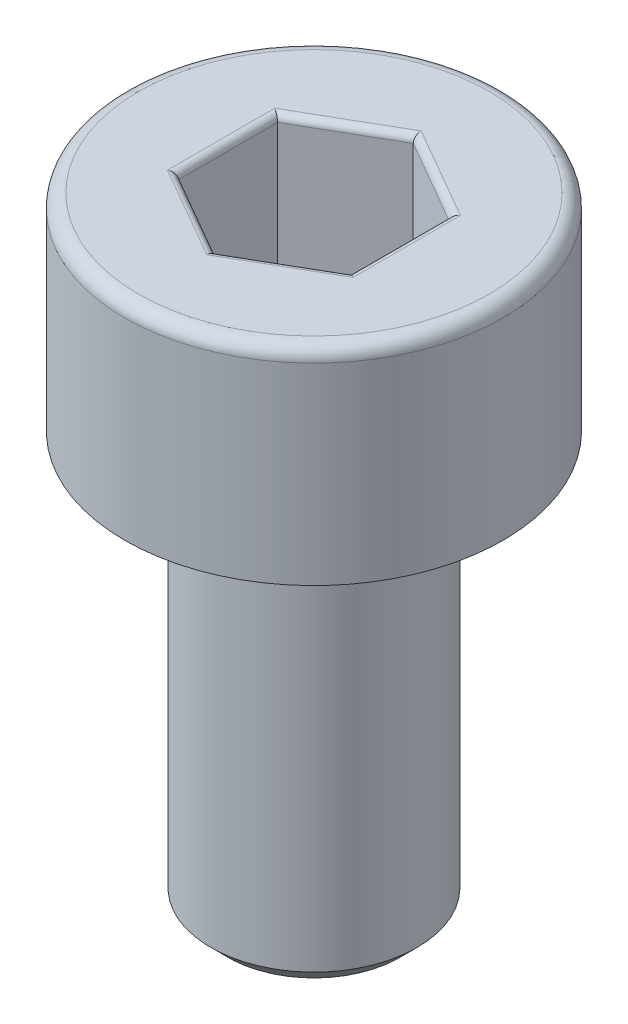
ISO-10303-21;
HEADER;
FILE_DESCRIPTION(('STEP AP214'),'2;1');
FILE_NAME('part.step','',(''),(''),'','','');
FILE_SCHEMA(('AUTOMOTIVE_DESIGN { 1 0 10303 214 1 1 1 1 }'));
ENDSEC;
DATA;
#1=APPLICATION_CONTEXT('core data for automotive mechanical design processes');
#2=APPLICATION_PROTOCOL_DEFINITION('international standard','automotive_design',2000,#1);
#3=PRODUCT_CONTEXT('',#1,'mechanical');
#4=PRODUCT('Part','Part','',(#3));
#5=PRODUCT_RELATED_PRODUCT_CATEGORY('part','',(#4));
#6=PRODUCT_DEFINITION_FORMATION('','',#4);
#7=PRODUCT_DEFINITION_CONTEXT('part definition',#1,'design');
#8=PRODUCT_DEFINITION('design','',#6,#7);
#9=PRODUCT_DEFINITION_SHAPE('','',#8);
#10=(LENGTH_UNIT() NAMED_UNIT(*) SI_UNIT(.MILLI.,.METRE.));
#11=(NAMED_UNIT(*) PLANE_ANGLE_UNIT() SI_UNIT($,.RADIAN.));
#12=(NAMED_UNIT(*) SI_UNIT($,.STERADIAN.) SOLID_ANGLE_UNIT());
#13=UNCERTAINTY_MEASURE_WITH_UNIT(LENGTH_MEASURE(1.E-05),#10,'distance_accuracy_value','');
#14=(GEOMETRIC_REPRESENTATION_CONTEXT(3) GLOBAL_UNCERTAINTY_ASSIGNED_CONTEXT((#13)) GLOBAL_UNIT_ASSIGNED_CONTEXT((#10,
#11,#12)) REPRESENTATION_CONTEXT('',''));
#15=CARTESIAN_POINT('',(0.,0.,0.));
#16=DIRECTION('',(0.,0.,1.));
#17=DIRECTION('',(1.,0.,0.));
#18=AXIS2_PLACEMENT_3D('',#15,#16,#17);
#19=CARTESIAN_POINT('',(0.,-9.,0.));
#20=DIRECTION('',(0.,-1.,0.));
#21=DIRECTION('',(0.,0.,-1.));
#22=AXIS2_PLACEMENT_3D('',#19,#20,#21);
#23=PLANE('',#22);
#24=CARTESIAN_POINT('',(0.,-9.,0.));
#25=DIRECTION('',(0.,-1.,0.));
#26=DIRECTION('',(0.,0.,-1.));
#27=AXIS2_PLACEMENT_3D('',#24,#25,#26);
#28=CIRCLE('',#27,1.25);
#29=CARTESIAN_POINT('',(0.,-9.,-1.25));
#30=VERTEX_POINT('',#29);
#31=EDGE_CURVE('E263',#30,#30,#28,.T.);
#32=ORIENTED_EDGE('',*,*,#31,.T.);
#33=EDGE_LOOP('',(#32));
#34=FACE_BOUND('',#33,.T.);
#35=ADVANCED_FACE('F35',(#34),#23,.T.);
#36=CARTESIAN_POINT('',(0.,0.,0.));
#37=DIRECTION('',(0.,1.,0.));
#38=DIRECTION('',(0.,0.,1.));
#39=AXIS2_PLACEMENT_3D('',#36,#37,#38);
#40=CYLINDRICAL_SURFACE('',#39,1.5);
#41=CARTESIAN_POINT('',(0.,-3.25,0.));
#42=DIRECTION('',(0.,-1.,0.));
#43=DIRECTION('',(0.,0.,-1.));
#44=AXIS2_PLACEMENT_3D('',#41,#42,#43);
#45=CIRCLE('',#44,1.5);
#46=CARTESIAN_POINT('',(0.,-3.25,-1.5));
#47=VERTEX_POINT('',#46);
#48=EDGE_CURVE('E260',#47,#47,#45,.T.);
#49=ORIENTED_EDGE('',*,*,#48,.T.);
#50=EDGE_LOOP('',(#49));
#51=FACE_BOUND('',#50,.T.);
#52=CARTESIAN_POINT('',(0.,-8.75,0.));
#53=DIRECTION('',(0.,-1.,0.));
#54=DIRECTION('',(0.,0.,-1.));
#55=AXIS2_PLACEMENT_3D('',#52,#53,#54);
#56=CIRCLE('',#55,1.5);
#57=CARTESIAN_POINT('',(0.,-8.75,-1.5));
#58=VERTEX_POINT('',#57);
#59=EDGE_CURVE('E257',#58,#58,#56,.F.);
#60=ORIENTED_EDGE('',*,*,#59,.T.);
#61=EDGE_LOOP('',(#60));
#62=FACE_BOUND('',#61,.T.);
#63=ADVANCED_FACE('F289',(#51,#62),#40,.T.);
#64=CARTESIAN_POINT('',(-1.5,-3.,0.));
#65=DIRECTION('',(0.,-1.,0.));
#66=DIRECTION('',(0.,0.,-1.));
#67=AXIS2_PLACEMENT_3D('',#64,#65,#66);
#68=PLANE('',#67);
#69=CARTESIAN_POINT('',(0.,-3.,0.));
#70=DIRECTION('',(0.,-1.,0.));
#71=DIRECTION('',(0.,0.,-1.));
#72=AXIS2_PLACEMENT_3D('',#69,#70,#71);
#73=CIRCLE('',#72,1.75);
#74=CARTESIAN_POINT('',(0.,-3.,-1.75));
#75=VERTEX_POINT('',#74);
#76=EDGE_CURVE('E254',#75,#75,#73,.F.);
#77=ORIENTED_EDGE('',*,*,#76,.T.);
#78=EDGE_LOOP('',(#77));
#79=FACE_BOUND('',#78,.T.);
#80=CARTESIAN_POINT('',(0.,-3.,0.));
#81=DIRECTION('',(0.,1.,0.));
#82=DIRECTION('',(0.,0.,1.));
#83=AXIS2_PLACEMENT_3D('',#80,#81,#82);
#84=CIRCLE('',#83,2.75);
#85=CARTESIAN_POINT('',(0.,-3.,2.75));
#86=VERTEX_POINT('',#85);
#87=EDGE_CURVE('E251',#86,#86,#84,.T.);
#88=ORIENTED_EDGE('',*,*,#87,.F.);
#89=EDGE_LOOP('',(#88));
#90=FACE_BOUND('',#89,.T.);
#91=ADVANCED_FACE('F295',(#79,#90),#68,.T.);
#92=CARTESIAN_POINT('',(0.,0.,0.));
#93=DIRECTION('',(0.,1.,0.));
#94=DIRECTION('',(0.,0.,1.));
#95=AXIS2_PLACEMENT_3D('',#92,#93,#94);
#96=CYLINDRICAL_SURFACE('',#95,2.75);
#97=CARTESIAN_POINT('',(0.,-0.2,0.));
#98=DIRECTION('',(0.,1.,0.));
#99=DIRECTION('',(0.,0.,1.));
#100=AXIS2_PLACEMENT_3D('',#97,#98,#99);
#101=CIRCLE('',#100,2.75);
#102=CARTESIAN_POINT('',(0.,-0.2,2.75));
#103=VERTEX_POINT('',#102);
#104=EDGE_CURVE('E161',#103,#103,#101,.F.);
#105=ORIENTED_EDGE('',*,*,#104,.T.);
#106=EDGE_LOOP('',(#105));
#107=FACE_BOUND('',#106,.T.);
#108=ORIENTED_EDGE('',*,*,#87,.T.);
#109=EDGE_LOOP('',(#108));
#110=FACE_BOUND('',#109,.T.);
#111=ADVANCED_FACE('F305',(#107,#110),#96,.T.);
#112=CARTESIAN_POINT('',(-2.75,0.,0.));
#113=DIRECTION('',(0.,1.,0.));
#114=DIRECTION('',(0.,0.,1.));
#115=AXIS2_PLACEMENT_3D('',#112,#113,#114);
#116=PLANE('',#115);
#117=DIRECTION('',(0.,0.,1.));
#118=VECTOR('',#117,1.);
#119=CARTESIAN_POINT('',(-1.35,0.,-0.721687836487033));
#120=LINE('',#119,#118);
#121=CARTESIAN_POINT('',(-1.35,0.,0.779422863405995));
#122=VERTEX_POINT('',#121);
#123=CARTESIAN_POINT('',(-1.35,0.,-0.779422863405995));
#124=VERTEX_POINT('',#123);
#125=EDGE_CURVE('E177',#122,#124,#120,.F.);
#126=ORIENTED_EDGE('',*,*,#125,.T.);
#127=DIRECTION('',(-0.866025403784439,0.,0.5));
#128=VECTOR('',#127,1.);
#129=CARTESIAN_POINT('',(-0.0500000000000002,0.,-1.52997821335251));
#130=LINE('',#129,#128);
#131=CARTESIAN_POINT('',(0.,0.,-1.55884572681199));
#132=VERTEX_POINT('',#131);
#133=EDGE_CURVE('E136',#124,#132,#130,.F.);
#134=ORIENTED_EDGE('',*,*,#133,.T.);
#135=DIRECTION('',(-0.866025403784439,0.,-0.5));
#136=VECTOR('',#135,1.);
#137=CARTESIAN_POINT('',(1.3,0.,-0.808290376865477));
#138=LINE('',#137,#136);
#139=CARTESIAN_POINT('',(1.35,0.,-0.779422863405995));
#140=VERTEX_POINT('',#139);
#141=EDGE_CURVE('E163',#132,#140,#138,.F.);
#142=ORIENTED_EDGE('',*,*,#141,.T.);
#143=DIRECTION('',(0.,0.,-1.));
#144=VECTOR('',#143,1.);
#145=CARTESIAN_POINT('',(1.35,0.,0.721687836487034));
#146=LINE('',#145,#144);
#147=CARTESIAN_POINT('',(1.35,0.,0.779422863405996));
#148=VERTEX_POINT('',#147);
#149=EDGE_CURVE('E171',#140,#148,#146,.F.);
#150=ORIENTED_EDGE('',*,*,#149,.T.);
#151=DIRECTION('',(0.866025403784439,0.,-0.5));
#152=VECTOR('',#151,1.);
#153=CARTESIAN_POINT('',(0.05,0.,1.52997821335251));
#154=LINE('',#153,#152);
#155=CARTESIAN_POINT('',(0.,0.,1.55884572681199));
#156=VERTEX_POINT('',#155);
#157=EDGE_CURVE('E173',#148,#156,#154,.F.);
#158=ORIENTED_EDGE('',*,*,#157,.T.);
#159=DIRECTION('',(0.866025403784438,0.,0.5));
#160=VECTOR('',#159,1.);
#161=CARTESIAN_POINT('',(-1.3,0.,0.808290376865476));
#162=LINE('',#161,#160);
#163=EDGE_CURVE('E175',#156,#122,#162,.F.);
#164=ORIENTED_EDGE('',*,*,#163,.T.);
#165=EDGE_LOOP('',(#126,#134,#142,#150,#158,#164));
#166=FACE_BOUND('',#165,.T.);
#167=CARTESIAN_POINT('',(0.,0.,0.));
#168=DIRECTION('',(0.,1.,0.));
#169=DIRECTION('',(0.,0.,1.));
#170=AXIS2_PLACEMENT_3D('',#167,#168,#169);
#171=CIRCLE('',#170,2.55);
#172=CARTESIAN_POINT('',(0.,0.,2.55));
#173=VERTEX_POINT('',#172);
#174=EDGE_CURVE('E166',#173,#173,#171,.T.);
#175=ORIENTED_EDGE('',*,*,#174,.T.);
#176=EDGE_LOOP('',(#175));
#177=FACE_BOUND('',#176,.T.);
#178=ADVANCED_FACE('F268',(#166,#177),#116,.T.);
#179=CARTESIAN_POINT('',(0.,-3.,0.));
#180=DIRECTION('',(0.,1.,0.));
#181=DIRECTION('',(0.,0.,1.));
#182=AXIS2_PLACEMENT_3D('',#179,#180,#181);
#183=CONICAL_SURFACE('',#182,1.75,0.785398163397453);
#184=ORIENTED_EDGE('',*,*,#48,.F.);
#185=EDGE_LOOP('',(#184));
#186=FACE_BOUND('',#185,.T.);
#187=ORIENTED_EDGE('',*,*,#76,.F.);
#188=EDGE_LOOP('',(#187));
#189=FACE_BOUND('',#188,.T.);
#190=ADVANCED_FACE('F283',(#186,#189),#183,.T.);
#191=CARTESIAN_POINT('',(0.,-8.75,0.));
#192=DIRECTION('',(0.,1.,0.));
#193=DIRECTION('',(0.,0.,1.));
#194=AXIS2_PLACEMENT_3D('',#191,#192,#193);
#195=CONICAL_SURFACE('',#194,1.5,0.785398163397454);
#196=ORIENTED_EDGE('',*,*,#31,.F.);
#197=EDGE_LOOP('',(#196));
#198=FACE_BOUND('',#197,.T.);
#199=ORIENTED_EDGE('',*,*,#59,.F.);
#200=EDGE_LOOP('',(#199));
#201=FACE_BOUND('',#200,.T.);
#202=ADVANCED_FACE('F273',(#198,#201),#195,.T.);
#203=CARTESIAN_POINT('',(0.,-0.2,0.));
#204=DIRECTION('',(0.,1.,0.));
#205=DIRECTION('',(0.,0.,1.));
#206=AXIS2_PLACEMENT_3D('',#203,#204,#205);
#207=TOROIDAL_SURFACE('',#206,2.55,0.2);
#208=ORIENTED_EDGE('',*,*,#104,.F.);
#209=EDGE_LOOP('',(#208));
#210=FACE_BOUND('',#209,.T.);
#211=ORIENTED_EDGE('',*,*,#174,.F.);
#212=EDGE_LOOP('',(#211));
#213=FACE_BOUND('',#212,.T.);
#214=ADVANCED_FACE('F270',(#210,#213),#207,.T.);
#215=CARTESIAN_POINT('',(1.25,-2.,-0.721687836487033));
#216=DIRECTION('',(0.5,0.,-0.866025403784439));
#217=DIRECTION('',(-0.866025403784439,0.,-0.5));
#218=AXIS2_PLACEMENT_3D('',#215,#216,#217);
#219=PLANE('',#218);
#220=DIRECTION('',(0.,1.,0.));
#221=VECTOR('',#220,1.);
#222=CARTESIAN_POINT('',(1.25,-2.,-0.721687836487033));
#223=LINE('',#222,#221);
#224=CARTESIAN_POINT('',(1.25,-1.9,-0.721687836487033));
#225=VERTEX_POINT('',#224);
#226=CARTESIAN_POINT('',(1.25,-0.1,-0.721687836487033));
#227=VERTEX_POINT('',#226);
#228=EDGE_CURVE('E245',#225,#227,#223,.T.);
#229=ORIENTED_EDGE('',*,*,#228,.T.);
#230=DIRECTION('',(-0.866025403784439,0.,-0.5));
#231=VECTOR('',#230,1.);
#232=CARTESIAN_POINT('',(0.,-0.1,-1.44337567297406));
#233=LINE('',#232,#231);
#234=CARTESIAN_POINT('',(0.,-0.1,-1.44337567297406));
#235=VERTEX_POINT('',#234);
#236=EDGE_CURVE('E197',#227,#235,#233,.T.);
#237=ORIENTED_EDGE('',*,*,#236,.T.);
#238=DIRECTION('',(0.,1.,0.));
#239=VECTOR('',#238,1.);
#240=CARTESIAN_POINT('',(0.,-2.,-1.44337567297406));
#241=LINE('',#240,#239);
#242=CARTESIAN_POINT('',(0.,-1.9,-1.44337567297406));
#243=VERTEX_POINT('',#242);
#244=EDGE_CURVE('E147',#243,#235,#241,.T.);
#245=ORIENTED_EDGE('',*,*,#244,.F.);
#246=DIRECTION('',(-0.866025403784439,0.,-0.5));
#247=VECTOR('',#246,1.);
#248=CARTESIAN_POINT('',(1.25,-1.9,-0.721687836487033));
#249=LINE('',#248,#247);
#250=EDGE_CURVE('E195',#243,#225,#249,.F.);
#251=ORIENTED_EDGE('',*,*,#250,.T.);
#252=EDGE_LOOP('',(#229,#237,#245,#251));
#253=FACE_BOUND('',#252,.T.);
#254=ADVANCED_FACE('F272',(#253),#219,.F.);
#255=CARTESIAN_POINT('',(1.25,-2.,0.721687836487034));
#256=DIRECTION('',(1.,0.,0.));
#257=DIRECTION('',(0.,0.,-1.));
#258=AXIS2_PLACEMENT_3D('',#255,#256,#257);
#259=PLANE('',#258);
#260=DIRECTION('',(0.,1.,0.));
#261=VECTOR('',#260,1.);
#262=CARTESIAN_POINT('',(1.25,-2.,0.721687836487034));
#263=LINE('',#262,#261);
#264=CARTESIAN_POINT('',(1.25,-1.9,0.721687836487034));
#265=VERTEX_POINT('',#264);
#266=CARTESIAN_POINT('',(1.25,-0.1,0.721687836487034));
#267=VERTEX_POINT('',#266);
#268=EDGE_CURVE('E242',#265,#267,#263,.T.);
#269=ORIENTED_EDGE('',*,*,#268,.T.);
#270=DIRECTION('',(0.,0.,-1.));
#271=VECTOR('',#270,1.);
#272=CARTESIAN_POINT('',(1.25,-0.1,-0.721687836487033));
#273=LINE('',#272,#271);
#274=EDGE_CURVE('E193',#267,#227,#273,.T.);
#275=ORIENTED_EDGE('',*,*,#274,.T.);
#276=ORIENTED_EDGE('',*,*,#228,.F.);
#277=DIRECTION('',(0.,0.,-1.));
#278=VECTOR('',#277,1.);
#279=CARTESIAN_POINT('',(1.25,-1.9,0.721687836487034));
#280=LINE('',#279,#278);
#281=EDGE_CURVE('E190',#225,#265,#280,.F.);
#282=ORIENTED_EDGE('',*,*,#281,.T.);
#283=EDGE_LOOP('',(#269,#275,#276,#282));
#284=FACE_BOUND('',#283,.T.);
#285=ADVANCED_FACE('F280',(#284),#259,.F.);
#286=CARTESIAN_POINT('',(0.,-2.,1.44337567297407));
#287=DIRECTION('',(0.5,0.,0.866025403784439));
#288=DIRECTION('',(0.866025403784439,0.,-0.5));
#289=AXIS2_PLACEMENT_3D('',#286,#287,#288);
#290=PLANE('',#289);
#291=DIRECTION('',(0.,1.,0.));
#292=VECTOR('',#291,1.);
#293=CARTESIAN_POINT('',(0.,-2.,1.44337567297407));
#294=LINE('',#293,#292);
#295=CARTESIAN_POINT('',(0.,-1.9,1.44337567297407));
#296=VERTEX_POINT('',#295);
#297=CARTESIAN_POINT('',(0.,-0.1,1.44337567297407));
#298=VERTEX_POINT('',#297);
#299=EDGE_CURVE('E239',#296,#298,#294,.T.);
#300=ORIENTED_EDGE('',*,*,#299,.T.);
#301=DIRECTION('',(0.866025403784439,0.,-0.5));
#302=VECTOR('',#301,1.);
#303=CARTESIAN_POINT('',(1.25,-0.1,0.721687836487034));
#304=LINE('',#303,#302);
#305=EDGE_CURVE('E188',#298,#267,#304,.T.);
#306=ORIENTED_EDGE('',*,*,#305,.T.);
#307=ORIENTED_EDGE('',*,*,#268,.F.);
#308=DIRECTION('',(0.866025403784439,0.,-0.5));
#309=VECTOR('',#308,1.);
#310=CARTESIAN_POINT('',(0.,-1.9,1.44337567297407));
#311=LINE('',#310,#309);
#312=EDGE_CURVE('E186',#265,#296,#311,.F.);
#313=ORIENTED_EDGE('',*,*,#312,.T.);
#314=EDGE_LOOP('',(#300,#306,#307,#313));
#315=FACE_BOUND('',#314,.T.);
#316=ADVANCED_FACE('F329',(#315),#290,.F.);
#317=CARTESIAN_POINT('',(-1.25,-2.,0.721687836487033));
#318=DIRECTION('',(-0.5,0.,0.866025403784439));
#319=DIRECTION('',(0.866025403784438,0.,0.5));
#320=AXIS2_PLACEMENT_3D('',#317,#318,#319);
#321=PLANE('',#320);
#322=DIRECTION('',(0.,1.,0.));
#323=VECTOR('',#322,1.);
#324=CARTESIAN_POINT('',(-1.25,-2.,0.721687836487033));
#325=LINE('',#324,#323);
#326=CARTESIAN_POINT('',(-1.25,-1.9,0.721687836487033));
#327=VERTEX_POINT('',#326);
#328=CARTESIAN_POINT('',(-1.25,-0.1,0.721687836487033));
#329=VERTEX_POINT('',#328);
#330=EDGE_CURVE('E130',#327,#329,#325,.T.);
#331=ORIENTED_EDGE('',*,*,#330,.T.);
#332=DIRECTION('',(0.866025403784438,0.,0.5));
#333=VECTOR('',#332,1.);
#334=CARTESIAN_POINT('',(0.,-0.1,1.44337567297407));
#335=LINE('',#334,#333);
#336=EDGE_CURVE('E184',#329,#298,#335,.T.);
#337=ORIENTED_EDGE('',*,*,#336,.T.);
#338=ORIENTED_EDGE('',*,*,#299,.F.);
#339=DIRECTION('',(0.866025403784438,0.,0.5));
#340=VECTOR('',#339,1.);
#341=CARTESIAN_POINT('',(-1.25,-1.9,0.721687836487033));
#342=LINE('',#341,#340);
#343=EDGE_CURVE('E182',#296,#327,#342,.F.);
#344=ORIENTED_EDGE('',*,*,#343,.T.);
#345=EDGE_LOOP('',(#331,#337,#338,#344));
#346=FACE_BOUND('',#345,.T.);
#347=ADVANCED_FACE('F236',(#346),#321,.F.);
#348=CARTESIAN_POINT('',(-1.25,-2.,-0.721687836487033));
#349=DIRECTION('',(-1.,0.,0.));
#350=DIRECTION('',(0.,0.,1.));
#351=AXIS2_PLACEMENT_3D('',#348,#349,#350);
#352=PLANE('',#351);
#353=DIRECTION('',(0.,1.,0.));
#354=VECTOR('',#353,1.);
#355=CARTESIAN_POINT('',(-1.25,-2.,-0.721687836487033));
#356=LINE('',#355,#354);
#357=CARTESIAN_POINT('',(-1.25,-1.9,-0.721687836487033));
#358=VERTEX_POINT('',#357);
#359=CARTESIAN_POINT('',(-1.25,-0.1,-0.721687836487033));
#360=VERTEX_POINT('',#359);
#361=EDGE_CURVE('E128',#358,#360,#356,.T.);
#362=ORIENTED_EDGE('',*,*,#361,.T.);
#363=DIRECTION('',(0.,0.,1.));
#364=VECTOR('',#363,1.);
#365=CARTESIAN_POINT('',(-1.25,-0.1,0.721687836487033));
#366=LINE('',#365,#364);
#367=EDGE_CURVE('E135',#360,#329,#366,.T.);
#368=ORIENTED_EDGE('',*,*,#367,.T.);
#369=ORIENTED_EDGE('',*,*,#330,.F.);
#370=DIRECTION('',(0.,0.,1.));
#371=VECTOR('',#370,1.);
#372=CARTESIAN_POINT('',(-1.25,-1.9,-0.721687836487033));
#373=LINE('',#372,#371);
#374=EDGE_CURVE('E125',#327,#358,#373,.F.);
#375=ORIENTED_EDGE('',*,*,#374,.T.);
#376=EDGE_LOOP('',(#362,#368,#369,#375));
#377=FACE_BOUND('',#376,.T.);
#378=ADVANCED_FACE('F127',(#377),#352,.F.);
#379=CARTESIAN_POINT('',(0.,-2.,-1.44337567297406));
#380=DIRECTION('',(-0.5,0.,-0.866025403784439));
#381=DIRECTION('',(-0.866025403784439,0.,0.5));
#382=AXIS2_PLACEMENT_3D('',#379,#380,#381);
#383=PLANE('',#382);
#384=ORIENTED_EDGE('',*,*,#244,.T.);
#385=DIRECTION('',(-0.866025403784439,0.,0.5));
#386=VECTOR('',#385,1.);
#387=CARTESIAN_POINT('',(-1.25,-0.1,-0.721687836487032));
#388=LINE('',#387,#386);
#389=EDGE_CURVE('E146',#235,#360,#388,.T.);
#390=ORIENTED_EDGE('',*,*,#389,.T.);
#391=ORIENTED_EDGE('',*,*,#361,.F.);
#392=DIRECTION('',(-0.866025403784439,0.,0.5));
#393=VECTOR('',#392,1.);
#394=CARTESIAN_POINT('',(0.,-1.9,-1.44337567297406));
#395=LINE('',#394,#393);
#396=EDGE_CURVE('E143',#358,#243,#395,.F.);
#397=ORIENTED_EDGE('',*,*,#396,.T.);
#398=EDGE_LOOP('',(#384,#390,#391,#397));
#399=FACE_BOUND('',#398,.T.);
#400=ADVANCED_FACE('F141',(#399),#383,.F.);
#401=CARTESIAN_POINT('',(1.25,-2.,-0.721687836487033));
#402=DIRECTION('',(0.,-1.,0.));
#403=DIRECTION('',(0.,0.,-1.));
#404=AXIS2_PLACEMENT_3D('',#401,#402,#403);
#405=PLANE('',#404);
#406=DIRECTION('',(0.866025403784439,0.,-0.5));
#407=VECTOR('',#406,1.);
#408=CARTESIAN_POINT('',(1.2,-2.,0.63508529610859));
#409=LINE('',#408,#407);
#410=CARTESIAN_POINT('',(0.,-2.,1.32790561913614));
#411=VERTEX_POINT('',#410);
#412=CARTESIAN_POINT('',(1.15,-2.,0.663952809568071));
#413=VERTEX_POINT('',#412);
#414=EDGE_CURVE('E44',#411,#413,#409,.T.);
#415=ORIENTED_EDGE('',*,*,#414,.T.);
#416=DIRECTION('',(0.,0.,-1.));
#417=VECTOR('',#416,1.);
#418=CARTESIAN_POINT('',(1.15,-2.,-0.721687836487033));
#419=LINE('',#418,#417);
#420=CARTESIAN_POINT('',(1.15,-2.,-0.66395280956807));
#421=VERTEX_POINT('',#420);
#422=EDGE_CURVE('E11',#413,#421,#419,.T.);
#423=ORIENTED_EDGE('',*,*,#422,.T.);
#424=DIRECTION('',(-0.866025403784439,0.,-0.5));
#425=VECTOR('',#424,1.);
#426=CARTESIAN_POINT('',(-0.0500000000000001,-2.,-1.35677313259562));
#427=LINE('',#426,#425);
#428=CARTESIAN_POINT('',(0.,-2.,-1.32790561913614));
#429=VERTEX_POINT('',#428);
#430=EDGE_CURVE('E199',#421,#429,#427,.T.);
#431=ORIENTED_EDGE('',*,*,#430,.T.);
#432=DIRECTION('',(-0.866025403784439,0.,0.5));
#433=VECTOR('',#432,1.);
#434=CARTESIAN_POINT('',(-1.2,-2.,-0.635085296108588));
#435=LINE('',#434,#433);
#436=CARTESIAN_POINT('',(-1.15,-2.,-0.66395280956807));
#437=VERTEX_POINT('',#436);
#438=EDGE_CURVE('E201',#429,#437,#435,.T.);
#439=ORIENTED_EDGE('',*,*,#438,.T.);
#440=DIRECTION('',(0.,0.,1.));
#441=VECTOR('',#440,1.);
#442=CARTESIAN_POINT('',(-1.15,-2.,0.721687836487033));
#443=LINE('',#442,#441);
#444=CARTESIAN_POINT('',(-1.15,-2.,0.66395280956807));
#445=VERTEX_POINT('',#444);
#446=EDGE_CURVE('E152',#437,#445,#443,.T.);
#447=ORIENTED_EDGE('',*,*,#446,.T.);
#448=DIRECTION('',(0.866025403784438,0.,0.5));
#449=VECTOR('',#448,1.);
#450=CARTESIAN_POINT('',(0.0499999999999999,-2.,1.35677313259562));
#451=LINE('',#450,#449);
#452=EDGE_CURVE('E55',#445,#411,#451,.T.);
#453=ORIENTED_EDGE('',*,*,#452,.T.);
#454=EDGE_LOOP('',(#415,#423,#431,#439,#447,#453));
#455=FACE_BOUND('',#454,.T.);
#456=ADVANCED_FACE('F324',(#455),#405,.F.);
#457=CARTESIAN_POINT('',(0.05,-0.1,1.52997821335251));
#458=DIRECTION('',(-0.866025403784439,0.,0.5));
#459=DIRECTION('',(0.5,0.,0.866025403784439));
#460=AXIS2_PLACEMENT_3D('',#457,#458,#459);
#461=CYLINDRICAL_SURFACE('',#460,0.1);
#462=CARTESIAN_POINT('',(0.,-0.1,1.55884572681199));
#463=DIRECTION('',(-1.,0.,0.));
#464=DIRECTION('',(0.,0.,-1.));
#465=AXIS2_PLACEMENT_3D('',#462,#463,#464);
#466=ELLIPSE('',#465,0.115470053837925,0.1);
#467=EDGE_CURVE('E216',#156,#298,#466,.T.);
#468=ORIENTED_EDGE('',*,*,#467,.F.);
#469=ORIENTED_EDGE('',*,*,#157,.F.);
#470=CARTESIAN_POINT('',(1.35,-0.1,0.779422863405997));
#471=DIRECTION('',(-0.5,0.,0.866025403784438));
#472=DIRECTION('',(-0.866025403784438,0.,-0.5));
#473=AXIS2_PLACEMENT_3D('',#470,#471,#472);
#474=ELLIPSE('',#473,0.115470053837925,0.1);
#475=EDGE_CURVE('E219',#267,#148,#474,.F.);
#476=ORIENTED_EDGE('',*,*,#475,.F.);
#477=ORIENTED_EDGE('',*,*,#305,.F.);
#478=EDGE_LOOP('',(#468,#469,#476,#477));
#479=FACE_BOUND('',#478,.T.);
#480=ADVANCED_FACE('F336',(#479),#461,.T.);
#481=CARTESIAN_POINT('',(1.35,-0.1,0.721687836487034));
#482=DIRECTION('',(0.,0.,1.));
#483=DIRECTION('',(1.,0.,0.));
#484=AXIS2_PLACEMENT_3D('',#481,#482,#483);
#485=CYLINDRICAL_SURFACE('',#484,0.1);
#486=ORIENTED_EDGE('',*,*,#475,.T.);
#487=ORIENTED_EDGE('',*,*,#149,.F.);
#488=CARTESIAN_POINT('',(1.35,-0.1,-0.779422863405995));
#489=DIRECTION('',(0.5,0.,0.866025403784439));
#490=DIRECTION('',(-0.866025403784439,0.,0.5));
#491=AXIS2_PLACEMENT_3D('',#488,#489,#490);
#492=ELLIPSE('',#491,0.115470053837925,0.1);
#493=EDGE_CURVE('E213',#227,#140,#492,.F.);
#494=ORIENTED_EDGE('',*,*,#493,.F.);
#495=ORIENTED_EDGE('',*,*,#274,.F.);
#496=EDGE_LOOP('',(#486,#487,#494,#495));
#497=FACE_BOUND('',#496,.T.);
#498=ADVANCED_FACE('F340',(#497),#485,.T.);
#499=CARTESIAN_POINT('',(-1.3,-0.1,0.808290376865476));
#500=DIRECTION('',(-0.866025403784438,0.,-0.5));
#501=DIRECTION('',(-0.5,0.,0.866025403784439));
#502=AXIS2_PLACEMENT_3D('',#499,#500,#501);
#503=CYLINDRICAL_SURFACE('',#502,0.1);
#504=ORIENTED_EDGE('',*,*,#467,.T.);
#505=ORIENTED_EDGE('',*,*,#336,.F.);
#506=CARTESIAN_POINT('',(-1.35,-0.1,0.779422863405995));
#507=DIRECTION('',(-0.5,0.,-0.866025403784439));
#508=DIRECTION('',(0.866025403784439,0.,-0.5));
#509=AXIS2_PLACEMENT_3D('',#506,#507,#508);
#510=ELLIPSE('',#509,0.115470053837925,0.1);
#511=EDGE_CURVE('E210',#122,#329,#510,.T.);
#512=ORIENTED_EDGE('',*,*,#511,.F.);
#513=ORIENTED_EDGE('',*,*,#163,.F.);
#514=EDGE_LOOP('',(#504,#505,#512,#513));
#515=FACE_BOUND('',#514,.T.);
#516=ADVANCED_FACE('F346',(#515),#503,.T.);
#517=CARTESIAN_POINT('',(1.3,-0.1,-0.808290376865477));
#518=DIRECTION('',(0.866025403784439,0.,0.5));
#519=DIRECTION('',(0.5,0.,-0.866025403784439));
#520=AXIS2_PLACEMENT_3D('',#517,#518,#519);
#521=CYLINDRICAL_SURFACE('',#520,0.1);
#522=ORIENTED_EDGE('',*,*,#493,.T.);
#523=ORIENTED_EDGE('',*,*,#141,.F.);
#524=CARTESIAN_POINT('',(0.,-0.1,-1.55884572681199));
#525=DIRECTION('',(1.,0.,0.));
#526=DIRECTION('',(0.,0.,-1.));
#527=AXIS2_PLACEMENT_3D('',#524,#525,#526);
#528=ELLIPSE('',#527,0.115470053837925,0.1);
#529=EDGE_CURVE('E208',#235,#132,#528,.F.);
#530=ORIENTED_EDGE('',*,*,#529,.F.);
#531=ORIENTED_EDGE('',*,*,#236,.F.);
#532=EDGE_LOOP('',(#522,#523,#530,#531));
#533=FACE_BOUND('',#532,.T.);
#534=ADVANCED_FACE('F376',(#533),#521,.T.);
#535=CARTESIAN_POINT('',(-1.35,-0.1,-0.721687836487033));
#536=DIRECTION('',(0.,0.,-1.));
#537=DIRECTION('',(-1.,0.,0.));
#538=AXIS2_PLACEMENT_3D('',#535,#536,#537);
#539=CYLINDRICAL_SURFACE('',#538,0.1);
#540=ORIENTED_EDGE('',*,*,#511,.T.);
#541=ORIENTED_EDGE('',*,*,#367,.F.);
#542=CARTESIAN_POINT('',(-1.35,-0.1,-0.779422863405995));
#543=DIRECTION('',(0.5,0.,-0.866025403784439));
#544=DIRECTION('',(0.866025403784439,0.,0.5));
#545=AXIS2_PLACEMENT_3D('',#542,#543,#544);
#546=ELLIPSE('',#545,0.115470053837925,0.1);
#547=EDGE_CURVE('E206',#124,#360,#546,.T.);
#548=ORIENTED_EDGE('',*,*,#547,.F.);
#549=ORIENTED_EDGE('',*,*,#125,.F.);
#550=EDGE_LOOP('',(#540,#541,#548,#549));
#551=FACE_BOUND('',#550,.T.);
#552=ADVANCED_FACE('F371',(#551),#539,.T.);
#553=CARTESIAN_POINT('',(-0.05,-0.1,-1.52997821335251));
#554=DIRECTION('',(0.866025403784439,0.,-0.5));
#555=DIRECTION('',(-0.5,0.,-0.866025403784439));
#556=AXIS2_PLACEMENT_3D('',#553,#554,#555);
#557=CYLINDRICAL_SURFACE('',#556,0.1);
#558=ORIENTED_EDGE('',*,*,#529,.T.);
#559=ORIENTED_EDGE('',*,*,#133,.F.);
#560=ORIENTED_EDGE('',*,*,#547,.T.);
#561=ORIENTED_EDGE('',*,*,#389,.F.);
#562=EDGE_LOOP('',(#558,#559,#560,#561));
#563=FACE_BOUND('',#562,.T.);
#564=ADVANCED_FACE('F367',(#563),#557,.T.);
#565=CARTESIAN_POINT('',(-1.15,-1.9,-0.721687836487033));
#566=DIRECTION('',(0.,0.,-1.));
#567=DIRECTION('',(-1.,0.,0.));
#568=AXIS2_PLACEMENT_3D('',#565,#566,#567);
#569=CYLINDRICAL_SURFACE('',#568,0.1);
#570=CARTESIAN_POINT('',(-1.15,-1.9,-0.663952809568069));
#571=DIRECTION('',(0.5,0.,-0.866025403784439));
#572=DIRECTION('',(-0.866025403784439,0.,-0.5));
#573=AXIS2_PLACEMENT_3D('',#570,#571,#572);
#574=ELLIPSE('',#573,0.115470053837925,0.1);
#575=EDGE_CURVE('E151',#358,#437,#574,.F.);
#576=ORIENTED_EDGE('',*,*,#575,.F.);
#577=ORIENTED_EDGE('',*,*,#374,.F.);
#578=CARTESIAN_POINT('',(-1.15,-1.9,0.66395280956807));
#579=DIRECTION('',(-0.5,0.,-0.866025403784439));
#580=DIRECTION('',(-0.866025403784439,0.,0.5));
#581=AXIS2_PLACEMENT_3D('',#578,#579,#580);
#582=ELLIPSE('',#581,0.115470053837925,0.1);
#583=EDGE_CURVE('E39',#445,#327,#582,.T.);
#584=ORIENTED_EDGE('',*,*,#583,.F.);
#585=ORIENTED_EDGE('',*,*,#446,.F.);
#586=EDGE_LOOP('',(#576,#577,#584,#585));
#587=FACE_BOUND('',#586,.T.);
#588=ADVANCED_FACE('F37',(#587),#569,.F.);
#589=CARTESIAN_POINT('',(0.0499999999999988,-1.9,1.35677313259562));
#590=DIRECTION('',(-0.866025403784438,0.,-0.5));
#591=DIRECTION('',(-0.5,0.,0.866025403784439));
#592=AXIS2_PLACEMENT_3D('',#589,#590,#591);
#593=CYLINDRICAL_SURFACE('',#592,0.1);
#594=ORIENTED_EDGE('',*,*,#583,.T.);
#595=ORIENTED_EDGE('',*,*,#343,.F.);
#596=CARTESIAN_POINT('',(0.,-1.9,1.32790561913614));
#597=DIRECTION('',(-1.,0.,0.));
#598=DIRECTION('',(0.,0.,1.));
#599=AXIS2_PLACEMENT_3D('',#596,#597,#598);
#600=ELLIPSE('',#599,0.115470053837925,0.1);
#601=EDGE_CURVE('E155',#411,#296,#600,.T.);
#602=ORIENTED_EDGE('',*,*,#601,.F.);
#603=ORIENTED_EDGE('',*,*,#452,.F.);
#604=EDGE_LOOP('',(#594,#595,#602,#603));
#605=FACE_BOUND('',#604,.T.);
#606=ADVANCED_FACE('F233',(#605),#593,.F.);
#607=CARTESIAN_POINT('',(0.675,-1.9,-1.71761705083914));
#608=DIRECTION('',(0.866025403784439,0.,-0.5));
#609=DIRECTION('',(-0.5,0.,-0.866025403784439));
#610=AXIS2_PLACEMENT_3D('',#607,#608,#609);
#611=CYLINDRICAL_SURFACE('',#610,0.1);
#612=ORIENTED_EDGE('',*,*,#575,.T.);
#613=ORIENTED_EDGE('',*,*,#438,.F.);
#614=CARTESIAN_POINT('',(0.,-1.9,-1.32790561913614));
#615=DIRECTION('',(1.,0.,0.));
#616=DIRECTION('',(0.,0.,-1.));
#617=AXIS2_PLACEMENT_3D('',#614,#615,#616);
#618=ELLIPSE('',#617,0.115470053837925,0.1);
#619=EDGE_CURVE('E159',#243,#429,#618,.F.);
#620=ORIENTED_EDGE('',*,*,#619,.F.);
#621=ORIENTED_EDGE('',*,*,#396,.F.);
#622=EDGE_LOOP('',(#612,#613,#620,#621));
#623=FACE_BOUND('',#622,.T.);
#624=ADVANCED_FACE('F157',(#623),#611,.F.);
#625=CARTESIAN_POINT('',(1.825,-1.9,0.274241377865074));
#626=DIRECTION('',(-0.866025403784439,0.,0.5));
#627=DIRECTION('',(0.5,0.,0.866025403784439));
#628=AXIS2_PLACEMENT_3D('',#625,#626,#627);
#629=CYLINDRICAL_SURFACE('',#628,0.1);
#630=ORIENTED_EDGE('',*,*,#601,.T.);
#631=ORIENTED_EDGE('',*,*,#312,.F.);
#632=CARTESIAN_POINT('',(1.15,-1.9,0.663952809568072));
#633=DIRECTION('',(-0.5,0.,0.866025403784438));
#634=DIRECTION('',(0.866025403784438,0.,0.5));
#635=AXIS2_PLACEMENT_3D('',#632,#633,#634);
#636=ELLIPSE('',#635,0.115470053837925,0.1);
#637=EDGE_CURVE('E224',#413,#265,#636,.T.);
#638=ORIENTED_EDGE('',*,*,#637,.F.);
#639=ORIENTED_EDGE('',*,*,#414,.F.);
#640=EDGE_LOOP('',(#630,#631,#638,#639));
#641=FACE_BOUND('',#640,.T.);
#642=ADVANCED_FACE('F230',(#641),#629,.F.);
#643=CARTESIAN_POINT('',(1.2,-1.9,-0.635085296108589));
#644=DIRECTION('',(0.866025403784439,0.,0.5));
#645=DIRECTION('',(0.5,0.,-0.866025403784439));
#646=AXIS2_PLACEMENT_3D('',#643,#644,#645);
#647=CYLINDRICAL_SURFACE('',#646,0.1);
#648=ORIENTED_EDGE('',*,*,#619,.T.);
#649=ORIENTED_EDGE('',*,*,#430,.F.);
#650=CARTESIAN_POINT('',(1.15,-1.9,-0.66395280956807));
#651=DIRECTION('',(0.5,0.,0.866025403784439));
#652=DIRECTION('',(-0.866025403784439,0.,0.5));
#653=AXIS2_PLACEMENT_3D('',#650,#651,#652);
#654=ELLIPSE('',#653,0.115470053837925,0.1);
#655=EDGE_CURVE('E222',#225,#421,#654,.F.);
#656=ORIENTED_EDGE('',*,*,#655,.F.);
#657=ORIENTED_EDGE('',*,*,#250,.F.);
#658=EDGE_LOOP('',(#648,#649,#656,#657));
#659=FACE_BOUND('',#658,.T.);
#660=ADVANCED_FACE('F355',(#659),#647,.F.);
#661=CARTESIAN_POINT('',(1.15,-1.9,-0.721687836487033));
#662=DIRECTION('',(0.,0.,1.));
#663=DIRECTION('',(1.,0.,0.));
#664=AXIS2_PLACEMENT_3D('',#661,#662,#663);
#665=CYLINDRICAL_SURFACE('',#664,0.1);
#666=ORIENTED_EDGE('',*,*,#637,.T.);
#667=ORIENTED_EDGE('',*,*,#281,.F.);
#668=ORIENTED_EDGE('',*,*,#655,.T.);
#669=ORIENTED_EDGE('',*,*,#422,.F.);
#670=EDGE_LOOP('',(#666,#667,#668,#669));
#671=FACE_BOUND('',#670,.T.);
#672=ADVANCED_FACE('F352',(#671),#665,.F.);
#673=CLOSED_SHELL('',(#35,#63,#91,#111,#178,#190,#202,#214,#254,#285,#316,#347,#378,#400,#456,
#480,#498,#516,#534,#552,#564,#588,#606,#624,#642,#660,#672));
#674=MANIFOLD_SOLID_BREP('B2',#673);
#675=ADVANCED_BREP_SHAPE_REPRESENTATION('',(#18,#674),#14);
#676=SHAPE_DEFINITION_REPRESENTATION(#9,#675);
ENDSEC;
END-ISO-10303-21;
